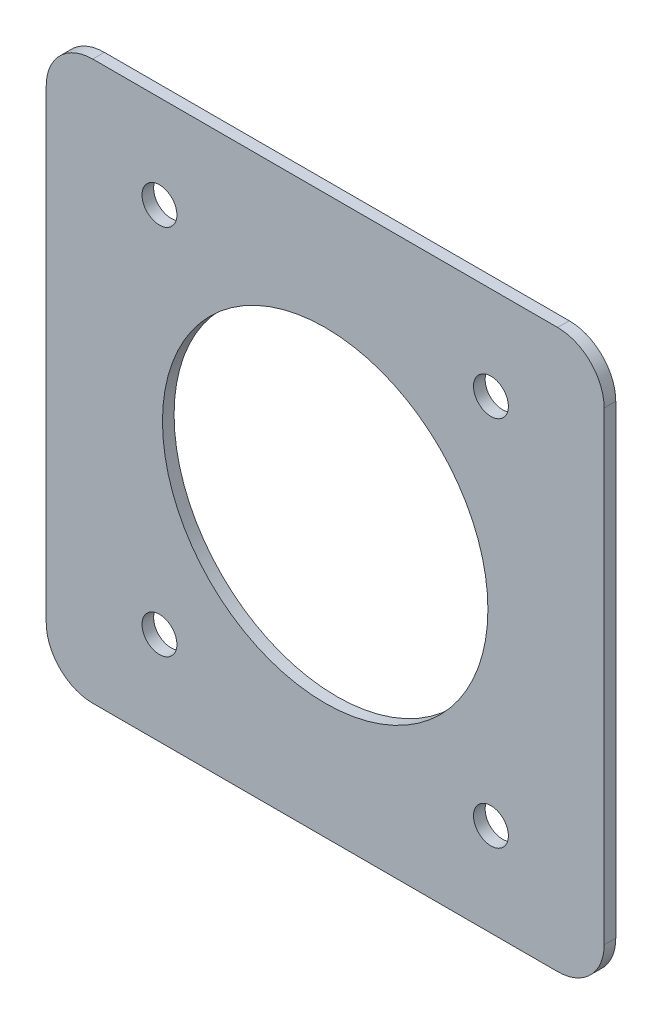
ISO-10303-21;
HEADER;
FILE_DESCRIPTION(('STEP AP214'),'2;1');
FILE_NAME('part.step','',(''),(''),'','','');
FILE_SCHEMA(('AUTOMOTIVE_DESIGN { 1 0 10303 214 1 1 1 1 }'));
ENDSEC;
DATA;
#1=APPLICATION_CONTEXT('core data for automotive mechanical design processes');
#2=APPLICATION_PROTOCOL_DEFINITION('international standard','automotive_design',2000,#1);
#3=PRODUCT_CONTEXT('',#1,'mechanical');
#4=PRODUCT('Part','Part','',(#3));
#5=PRODUCT_RELATED_PRODUCT_CATEGORY('part','',(#4));
#6=PRODUCT_DEFINITION_FORMATION('','',#4);
#7=PRODUCT_DEFINITION_CONTEXT('part definition',#1,'design');
#8=PRODUCT_DEFINITION('design','',#6,#7);
#9=PRODUCT_DEFINITION_SHAPE('','',#8);
#10=(LENGTH_UNIT() NAMED_UNIT(*) SI_UNIT(.MILLI.,.METRE.));
#11=(NAMED_UNIT(*) PLANE_ANGLE_UNIT() SI_UNIT($,.RADIAN.));
#12=(NAMED_UNIT(*) SI_UNIT($,.STERADIAN.) SOLID_ANGLE_UNIT());
#13=UNCERTAINTY_MEASURE_WITH_UNIT(LENGTH_MEASURE(1.E-05),#10,'distance_accuracy_value','');
#14=(GEOMETRIC_REPRESENTATION_CONTEXT(3) GLOBAL_UNCERTAINTY_ASSIGNED_CONTEXT((#13)) GLOBAL_UNIT_ASSIGNED_CONTEXT((#10,
#11,#12)) REPRESENTATION_CONTEXT('',''));
#15=CARTESIAN_POINT('',(0.,0.,0.));
#16=DIRECTION('',(0.,0.,1.));
#17=DIRECTION('',(1.,0.,0.));
#18=AXIS2_PLACEMENT_3D('',#15,#16,#17);
#19=CARTESIAN_POINT('',(-103.997719315894,137.785716341258,3.175));
#20=DIRECTION('',(0.,0.,-1.));
#21=DIRECTION('',(-1.,0.,0.));
#22=AXIS2_PLACEMENT_3D('',#19,#20,#21);
#23=CYLINDRICAL_SURFACE('',#22,12.7);
#24=CARTESIAN_POINT('',(-103.997719315894,137.785716341258,0.));
#25=DIRECTION('',(0.,0.,1.));
#26=DIRECTION('',(1.,0.,0.));
#27=AXIS2_PLACEMENT_3D('',#24,#25,#26);
#28=CIRCLE('',#27,12.7);
#29=CARTESIAN_POINT('',(-103.997719315894,150.485716341258,0.));
#30=VERTEX_POINT('',#29);
#31=CARTESIAN_POINT('',(-91.2977193158941,137.785716341258,0.));
#32=VERTEX_POINT('',#31);
#33=EDGE_CURVE('E142',#30,#32,#28,.F.);
#34=ORIENTED_EDGE('',*,*,#33,.F.);
#35=DIRECTION('',(0.,0.,-1.));
#36=VECTOR('',#35,1.);
#37=CARTESIAN_POINT('',(-103.997719315894,150.485716341258,3.175));
#38=LINE('',#37,#36);
#39=CARTESIAN_POINT('',(-103.997719315894,150.485716341258,3.175));
#40=VERTEX_POINT('',#39);
#41=EDGE_CURVE('E11',#40,#30,#38,.T.);
#42=ORIENTED_EDGE('',*,*,#41,.F.);
#43=CARTESIAN_POINT('',(-103.997719315894,137.785716341258,3.175));
#44=DIRECTION('',(0.,0.,1.));
#45=DIRECTION('',(1.,0.,0.));
#46=AXIS2_PLACEMENT_3D('',#43,#44,#45);
#47=CIRCLE('',#46,12.7);
#48=CARTESIAN_POINT('',(-91.2977193158941,137.785716341258,3.175));
#49=VERTEX_POINT('',#48);
#50=EDGE_CURVE('E172',#40,#49,#47,.F.);
#51=ORIENTED_EDGE('',*,*,#50,.T.);
#52=DIRECTION('',(0.,0.,-1.));
#53=VECTOR('',#52,1.);
#54=CARTESIAN_POINT('',(-91.2977193158941,137.785716341258,3.175));
#55=LINE('',#54,#53);
#56=EDGE_CURVE('E52',#49,#32,#55,.T.);
#57=ORIENTED_EDGE('',*,*,#56,.T.);
#58=EDGE_LOOP('',(#34,#42,#51,#57));
#59=FACE_BOUND('',#58,.T.);
#60=ADVANCED_FACE('F36',(#59),#23,.T.);
#61=CARTESIAN_POINT('',(0.,150.485716341258,3.175));
#62=DIRECTION('',(0.,1.,0.));
#63=DIRECTION('',(0.,0.,1.));
#64=AXIS2_PLACEMENT_3D('',#61,#62,#63);
#65=PLANE('',#64);
#66=DIRECTION('',(1.,0.,0.));
#67=VECTOR('',#66,1.);
#68=CARTESIAN_POINT('',(0.,150.485716341258,0.));
#69=LINE('',#68,#67);
#70=CARTESIAN_POINT('',(-230.997719315894,150.485716341258,0.));
#71=VERTEX_POINT('',#70);
#72=EDGE_CURVE('E144',#71,#30,#69,.T.);
#73=ORIENTED_EDGE('',*,*,#72,.F.);
#74=DIRECTION('',(0.,0.,-1.));
#75=VECTOR('',#74,1.);
#76=CARTESIAN_POINT('',(-230.997719315894,150.485716341258,3.175));
#77=LINE('',#76,#75);
#78=CARTESIAN_POINT('',(-230.997719315894,150.485716341258,3.175));
#79=VERTEX_POINT('',#78);
#80=EDGE_CURVE('E44',#79,#71,#77,.T.);
#81=ORIENTED_EDGE('',*,*,#80,.F.);
#82=DIRECTION('',(1.,0.,0.));
#83=VECTOR('',#82,1.);
#84=CARTESIAN_POINT('',(0.,150.485716341258,3.175));
#85=LINE('',#84,#83);
#86=EDGE_CURVE('E197',#79,#40,#85,.T.);
#87=ORIENTED_EDGE('',*,*,#86,.T.);
#88=ORIENTED_EDGE('',*,*,#41,.T.);
#89=EDGE_LOOP('',(#73,#81,#87,#88));
#90=FACE_BOUND('',#89,.T.);
#91=ADVANCED_FACE('F196',(#90),#65,.T.);
#92=CARTESIAN_POINT('',(-230.997719315894,137.785716341258,3.175));
#93=DIRECTION('',(0.,0.,-1.));
#94=DIRECTION('',(-1.,0.,0.));
#95=AXIS2_PLACEMENT_3D('',#92,#93,#94);
#96=CYLINDRICAL_SURFACE('',#95,12.7);
#97=CARTESIAN_POINT('',(-230.997719315894,137.785716341258,0.));
#98=DIRECTION('',(0.,0.,1.));
#99=DIRECTION('',(1.,0.,0.));
#100=AXIS2_PLACEMENT_3D('',#97,#98,#99);
#101=CIRCLE('',#100,12.7);
#102=CARTESIAN_POINT('',(-243.697719315894,137.785716341258,0.));
#103=VERTEX_POINT('',#102);
#104=EDGE_CURVE('E148',#71,#103,#101,.T.);
#105=ORIENTED_EDGE('',*,*,#104,.T.);
#106=DIRECTION('',(0.,0.,-1.));
#107=VECTOR('',#106,1.);
#108=CARTESIAN_POINT('',(-243.697719315894,137.785716341258,3.175));
#109=LINE('',#108,#107);
#110=CARTESIAN_POINT('',(-243.697719315894,137.785716341258,3.175));
#111=VERTEX_POINT('',#110);
#112=EDGE_CURVE('E179',#111,#103,#109,.T.);
#113=ORIENTED_EDGE('',*,*,#112,.F.);
#114=CARTESIAN_POINT('',(-230.997719315894,137.785716341258,3.175));
#115=DIRECTION('',(0.,0.,1.));
#116=DIRECTION('',(1.,0.,0.));
#117=AXIS2_PLACEMENT_3D('',#114,#115,#116);
#118=CIRCLE('',#117,12.7);
#119=EDGE_CURVE('E186',#79,#111,#118,.T.);
#120=ORIENTED_EDGE('',*,*,#119,.F.);
#121=ORIENTED_EDGE('',*,*,#80,.T.);
#122=EDGE_LOOP('',(#105,#113,#120,#121));
#123=FACE_BOUND('',#122,.T.);
#124=ADVANCED_FACE('F184',(#123),#96,.T.);
#125=CARTESIAN_POINT('',(-243.697719315894,0.,3.175));
#126=DIRECTION('',(1.,0.,0.));
#127=DIRECTION('',(0.,1.,0.));
#128=AXIS2_PLACEMENT_3D('',#125,#126,#127);
#129=PLANE('',#128);
#130=DIRECTION('',(0.,-1.,0.));
#131=VECTOR('',#130,1.);
#132=CARTESIAN_POINT('',(-243.697719315894,0.,0.));
#133=LINE('',#132,#131);
#134=CARTESIAN_POINT('',(-243.697719315894,10.7857163412583,0.));
#135=VERTEX_POINT('',#134);
#136=EDGE_CURVE('E150',#103,#135,#133,.T.);
#137=ORIENTED_EDGE('',*,*,#136,.T.);
#138=DIRECTION('',(0.,0.,-1.));
#139=VECTOR('',#138,1.);
#140=CARTESIAN_POINT('',(-243.697719315894,10.7857163412583,3.175));
#141=LINE('',#140,#139);
#142=CARTESIAN_POINT('',(-243.697719315894,10.7857163412583,3.175));
#143=VERTEX_POINT('',#142);
#144=EDGE_CURVE('E176',#143,#135,#141,.T.);
#145=ORIENTED_EDGE('',*,*,#144,.F.);
#146=DIRECTION('',(0.,-1.,0.));
#147=VECTOR('',#146,1.);
#148=CARTESIAN_POINT('',(-243.697719315894,0.,3.175));
#149=LINE('',#148,#147);
#150=EDGE_CURVE('E268',#111,#143,#149,.T.);
#151=ORIENTED_EDGE('',*,*,#150,.F.);
#152=ORIENTED_EDGE('',*,*,#112,.T.);
#153=EDGE_LOOP('',(#137,#145,#151,#152));
#154=FACE_BOUND('',#153,.T.);
#155=ADVANCED_FACE('F220',(#154),#129,.F.);
#156=CARTESIAN_POINT('',(-230.997719315894,10.7857163412582,3.175));
#157=DIRECTION('',(0.,0.,-1.));
#158=DIRECTION('',(-1.,0.,0.));
#159=AXIS2_PLACEMENT_3D('',#156,#157,#158);
#160=CYLINDRICAL_SURFACE('',#159,12.7);
#161=CARTESIAN_POINT('',(-230.997719315894,10.7857163412582,0.));
#162=DIRECTION('',(0.,0.,1.));
#163=DIRECTION('',(1.,0.,0.));
#164=AXIS2_PLACEMENT_3D('',#161,#162,#163);
#165=CIRCLE('',#164,12.7);
#166=CARTESIAN_POINT('',(-230.997719315894,-1.91428365874183,0.));
#167=VERTEX_POINT('',#166);
#168=EDGE_CURVE('E152',#135,#167,#165,.T.);
#169=ORIENTED_EDGE('',*,*,#168,.T.);
#170=DIRECTION('',(0.,0.,-1.));
#171=VECTOR('',#170,1.);
#172=CARTESIAN_POINT('',(-230.997719315894,-1.91428365874183,3.175));
#173=LINE('',#172,#171);
#174=CARTESIAN_POINT('',(-230.997719315894,-1.91428365874183,3.175));
#175=VERTEX_POINT('',#174);
#176=EDGE_CURVE('E122',#175,#167,#173,.T.);
#177=ORIENTED_EDGE('',*,*,#176,.F.);
#178=CARTESIAN_POINT('',(-230.997719315894,10.7857163412582,3.175));
#179=DIRECTION('',(0.,0.,1.));
#180=DIRECTION('',(1.,0.,0.));
#181=AXIS2_PLACEMENT_3D('',#178,#179,#180);
#182=CIRCLE('',#181,12.7);
#183=EDGE_CURVE('E110',#143,#175,#182,.T.);
#184=ORIENTED_EDGE('',*,*,#183,.F.);
#185=ORIENTED_EDGE('',*,*,#144,.T.);
#186=EDGE_LOOP('',(#169,#177,#184,#185));
#187=FACE_BOUND('',#186,.T.);
#188=ADVANCED_FACE('F225',(#187),#160,.T.);
#189=CARTESIAN_POINT('',(0.,-1.9142836587418,3.175));
#190=DIRECTION('',(0.,1.,0.));
#191=DIRECTION('',(-1.,0.,0.));
#192=AXIS2_PLACEMENT_3D('',#189,#190,#191);
#193=PLANE('',#192);
#194=DIRECTION('',(1.,0.,0.));
#195=VECTOR('',#194,1.);
#196=CARTESIAN_POINT('',(0.,-1.9142836587418,0.));
#197=LINE('',#196,#195);
#198=CARTESIAN_POINT('',(-103.997719315894,-1.91428365874181,0.));
#199=VERTEX_POINT('',#198);
#200=EDGE_CURVE('E119',#167,#199,#197,.T.);
#201=ORIENTED_EDGE('',*,*,#200,.T.);
#202=DIRECTION('',(0.,0.,-1.));
#203=VECTOR('',#202,1.);
#204=CARTESIAN_POINT('',(-103.997719315894,-1.91428365874181,3.175));
#205=LINE('',#204,#203);
#206=CARTESIAN_POINT('',(-103.997719315894,-1.91428365874181,3.175));
#207=VERTEX_POINT('',#206);
#208=EDGE_CURVE('E116',#207,#199,#205,.T.);
#209=ORIENTED_EDGE('',*,*,#208,.F.);
#210=DIRECTION('',(1.,0.,0.));
#211=VECTOR('',#210,1.);
#212=CARTESIAN_POINT('',(0.,-1.9142836587418,3.175));
#213=LINE('',#212,#211);
#214=EDGE_CURVE('E102',#175,#207,#213,.T.);
#215=ORIENTED_EDGE('',*,*,#214,.F.);
#216=ORIENTED_EDGE('',*,*,#176,.T.);
#217=EDGE_LOOP('',(#201,#209,#215,#216));
#218=FACE_BOUND('',#217,.T.);
#219=ADVANCED_FACE('F117',(#218),#193,.F.);
#220=CARTESIAN_POINT('',(-103.997719315894,10.7857163412582,3.175));
#221=DIRECTION('',(0.,0.,-1.));
#222=DIRECTION('',(-1.,0.,0.));
#223=AXIS2_PLACEMENT_3D('',#220,#221,#222);
#224=CYLINDRICAL_SURFACE('',#223,12.7);
#225=CARTESIAN_POINT('',(-103.997719315894,10.7857163412582,0.));
#226=DIRECTION('',(0.,0.,1.));
#227=DIRECTION('',(1.,0.,0.));
#228=AXIS2_PLACEMENT_3D('',#225,#226,#227);
#229=CIRCLE('',#228,12.7);
#230=CARTESIAN_POINT('',(-91.297719315894,10.7857163412583,0.));
#231=VERTEX_POINT('',#230);
#232=EDGE_CURVE('E155',#199,#231,#229,.T.);
#233=ORIENTED_EDGE('',*,*,#232,.T.);
#234=DIRECTION('',(0.,0.,-1.));
#235=VECTOR('',#234,1.);
#236=CARTESIAN_POINT('',(-91.297719315894,10.7857163412583,3.175));
#237=LINE('',#236,#235);
#238=CARTESIAN_POINT('',(-91.297719315894,10.7857163412583,3.175));
#239=VERTEX_POINT('',#238);
#240=EDGE_CURVE('E78',#239,#231,#237,.T.);
#241=ORIENTED_EDGE('',*,*,#240,.F.);
#242=CARTESIAN_POINT('',(-103.997719315894,10.7857163412582,3.175));
#243=DIRECTION('',(0.,0.,1.));
#244=DIRECTION('',(1.,0.,0.));
#245=AXIS2_PLACEMENT_3D('',#242,#243,#244);
#246=CIRCLE('',#245,12.7);
#247=EDGE_CURVE('E108',#207,#239,#246,.T.);
#248=ORIENTED_EDGE('',*,*,#247,.F.);
#249=ORIENTED_EDGE('',*,*,#208,.T.);
#250=EDGE_LOOP('',(#233,#241,#248,#249));
#251=FACE_BOUND('',#250,.T.);
#252=ADVANCED_FACE('F124',(#251),#224,.T.);
#253=CARTESIAN_POINT('',(-212.773219315894,125.085716341257,3.175));
#254=DIRECTION('',(0.,0.,-1.));
#255=DIRECTION('',(-1.,0.,0.));
#256=AXIS2_PLACEMENT_3D('',#253,#254,#255);
#257=CYLINDRICAL_SURFACE('',#256,4.76249999999992);
#258=CARTESIAN_POINT('',(-212.773219315894,125.085716341257,3.175));
#259=DIRECTION('',(0.,0.,1.));
#260=DIRECTION('',(1.,0.,0.));
#261=AXIS2_PLACEMENT_3D('',#258,#259,#260);
#262=CIRCLE('',#261,4.76249999999992);
#263=CARTESIAN_POINT('',(-208.010719315894,125.085716341257,3.175));
#264=VERTEX_POINT('',#263);
#265=EDGE_CURVE('E136',#264,#264,#262,.T.);
#266=ORIENTED_EDGE('',*,*,#265,.T.);
#267=EDGE_LOOP('',(#266));
#268=FACE_BOUND('',#267,.T.);
#269=CARTESIAN_POINT('',(-212.773219315894,125.085716341257,0.));
#270=DIRECTION('',(0.,0.,1.));
#271=DIRECTION('',(1.,0.,0.));
#272=AXIS2_PLACEMENT_3D('',#269,#270,#271);
#273=CIRCLE('',#272,4.76249999999992);
#274=CARTESIAN_POINT('',(-208.010719315894,125.085716341257,0.));
#275=VERTEX_POINT('',#274);
#276=EDGE_CURVE('E166',#275,#275,#273,.T.);
#277=ORIENTED_EDGE('',*,*,#276,.F.);
#278=EDGE_LOOP('',(#277));
#279=FACE_BOUND('',#278,.T.);
#280=ADVANCED_FACE('F232',(#268,#279),#257,.F.);
#281=CARTESIAN_POINT('',(-212.773219315894,23.4857163412565,3.175));
#282=DIRECTION('',(0.,0.,-1.));
#283=DIRECTION('',(-1.,0.,0.));
#284=AXIS2_PLACEMENT_3D('',#281,#282,#283);
#285=CYLINDRICAL_SURFACE('',#284,4.76249999999992);
#286=CARTESIAN_POINT('',(-212.773219315894,23.4857163412565,3.175));
#287=DIRECTION('',(0.,0.,1.));
#288=DIRECTION('',(1.,0.,0.));
#289=AXIS2_PLACEMENT_3D('',#286,#287,#288);
#290=CIRCLE('',#289,4.76249999999992);
#291=CARTESIAN_POINT('',(-208.010719315894,23.4857163412565,3.175));
#292=VERTEX_POINT('',#291);
#293=EDGE_CURVE('E133',#292,#292,#290,.T.);
#294=ORIENTED_EDGE('',*,*,#293,.T.);
#295=EDGE_LOOP('',(#294));
#296=FACE_BOUND('',#295,.T.);
#297=CARTESIAN_POINT('',(-212.773219315894,23.4857163412565,0.));
#298=DIRECTION('',(0.,0.,1.));
#299=DIRECTION('',(1.,0.,0.));
#300=AXIS2_PLACEMENT_3D('',#297,#298,#299);
#301=CIRCLE('',#300,4.76249999999992);
#302=CARTESIAN_POINT('',(-208.010719315894,23.4857163412565,0.));
#303=VERTEX_POINT('',#302);
#304=EDGE_CURVE('E163',#303,#303,#301,.T.);
#305=ORIENTED_EDGE('',*,*,#304,.F.);
#306=EDGE_LOOP('',(#305));
#307=FACE_BOUND('',#306,.T.);
#308=ADVANCED_FACE('F209',(#296,#307),#285,.F.);
#309=CARTESIAN_POINT('',(-122.222219315894,23.4857163412565,3.175));
#310=DIRECTION('',(0.,0.,-1.));
#311=DIRECTION('',(-1.,0.,0.));
#312=AXIS2_PLACEMENT_3D('',#309,#310,#311);
#313=CYLINDRICAL_SURFACE('',#312,4.76249999999992);
#314=CARTESIAN_POINT('',(-122.222219315894,23.4857163412565,3.175));
#315=DIRECTION('',(0.,0.,1.));
#316=DIRECTION('',(1.,0.,0.));
#317=AXIS2_PLACEMENT_3D('',#314,#315,#316);
#318=CIRCLE('',#317,4.76249999999992);
#319=CARTESIAN_POINT('',(-117.459719315894,23.4857163412565,3.175));
#320=VERTEX_POINT('',#319);
#321=EDGE_CURVE('E127',#320,#320,#318,.T.);
#322=ORIENTED_EDGE('',*,*,#321,.T.);
#323=EDGE_LOOP('',(#322));
#324=FACE_BOUND('',#323,.T.);
#325=CARTESIAN_POINT('',(-122.222219315894,23.4857163412565,0.));
#326=DIRECTION('',(0.,0.,1.));
#327=DIRECTION('',(1.,0.,0.));
#328=AXIS2_PLACEMENT_3D('',#325,#326,#327);
#329=CIRCLE('',#328,4.76249999999992);
#330=CARTESIAN_POINT('',(-117.459719315894,23.4857163412565,0.));
#331=VERTEX_POINT('',#330);
#332=EDGE_CURVE('E160',#331,#331,#329,.T.);
#333=ORIENTED_EDGE('',*,*,#332,.F.);
#334=EDGE_LOOP('',(#333));
#335=FACE_BOUND('',#334,.T.);
#336=ADVANCED_FACE('F201',(#324,#335),#313,.F.);
#337=CARTESIAN_POINT('',(-91.297719315894,0.,3.175));
#338=DIRECTION('',(1.,0.,0.));
#339=DIRECTION('',(0.,1.,0.));
#340=AXIS2_PLACEMENT_3D('',#337,#338,#339);
#341=PLANE('',#340);
#342=DIRECTION('',(0.,-1.,0.));
#343=VECTOR('',#342,1.);
#344=CARTESIAN_POINT('',(-91.297719315894,0.,0.));
#345=LINE('',#344,#343);
#346=EDGE_CURVE('E157',#32,#231,#345,.T.);
#347=ORIENTED_EDGE('',*,*,#346,.F.);
#348=ORIENTED_EDGE('',*,*,#56,.F.);
#349=DIRECTION('',(0.,-1.,0.));
#350=VECTOR('',#349,1.);
#351=CARTESIAN_POINT('',(-91.297719315894,0.,3.175));
#352=LINE('',#351,#350);
#353=EDGE_CURVE('E125',#49,#239,#352,.T.);
#354=ORIENTED_EDGE('',*,*,#353,.T.);
#355=ORIENTED_EDGE('',*,*,#240,.T.);
#356=EDGE_LOOP('',(#347,#348,#354,#355));
#357=FACE_BOUND('',#356,.T.);
#358=ADVANCED_FACE('F198',(#357),#341,.T.);
#359=CARTESIAN_POINT('',(-122.222219315894,125.085716341257,3.175));
#360=DIRECTION('',(0.,0.,-1.));
#361=DIRECTION('',(-1.,0.,0.));
#362=AXIS2_PLACEMENT_3D('',#359,#360,#361);
#363=CYLINDRICAL_SURFACE('',#362,4.76249999999992);
#364=CARTESIAN_POINT('',(-122.222219315894,125.085716341257,3.175));
#365=DIRECTION('',(0.,0.,1.));
#366=DIRECTION('',(1.,0.,0.));
#367=AXIS2_PLACEMENT_3D('',#364,#365,#366);
#368=CIRCLE('',#367,4.76249999999992);
#369=CARTESIAN_POINT('',(-117.459719315894,125.085716341257,3.175));
#370=VERTEX_POINT('',#369);
#371=EDGE_CURVE('E139',#370,#370,#368,.T.);
#372=ORIENTED_EDGE('',*,*,#371,.T.);
#373=EDGE_LOOP('',(#372));
#374=FACE_BOUND('',#373,.T.);
#375=CARTESIAN_POINT('',(-122.222219315894,125.085716341257,0.));
#376=DIRECTION('',(0.,0.,1.));
#377=DIRECTION('',(1.,0.,0.));
#378=AXIS2_PLACEMENT_3D('',#375,#376,#377);
#379=CIRCLE('',#378,4.76249999999992);
#380=CARTESIAN_POINT('',(-117.459719315894,125.085716341257,0.));
#381=VERTEX_POINT('',#380);
#382=EDGE_CURVE('E169',#381,#381,#379,.T.);
#383=ORIENTED_EDGE('',*,*,#382,.F.);
#384=EDGE_LOOP('',(#383));
#385=FACE_BOUND('',#384,.T.);
#386=ADVANCED_FACE('F200',(#374,#385),#363,.F.);
#387=CARTESIAN_POINT('',(0.,0.,3.175));
#388=DIRECTION('',(0.,0.,1.));
#389=DIRECTION('',(1.,0.,0.));
#390=AXIS2_PLACEMENT_3D('',#387,#388,#389);
#391=PLANE('',#390);
#392=CARTESIAN_POINT('',(-167.497719315894,74.2857163412582,3.175));
#393=DIRECTION('',(0.,0.,1.));
#394=DIRECTION('',(1.,0.,0.));
#395=AXIS2_PLACEMENT_3D('',#392,#393,#394);
#396=CIRCLE('',#395,44.45);
#397=CARTESIAN_POINT('',(-123.047719315894,74.2857163412582,3.175));
#398=VERTEX_POINT('',#397);
#399=EDGE_CURVE('E261',#398,#398,#396,.T.);
#400=ORIENTED_EDGE('',*,*,#399,.F.);
#401=EDGE_LOOP('',(#400));
#402=FACE_BOUND('',#401,.T.);
#403=ORIENTED_EDGE('',*,*,#50,.F.);
#404=ORIENTED_EDGE('',*,*,#86,.F.);
#405=ORIENTED_EDGE('',*,*,#119,.T.);
#406=ORIENTED_EDGE('',*,*,#150,.T.);
#407=ORIENTED_EDGE('',*,*,#183,.T.);
#408=ORIENTED_EDGE('',*,*,#214,.T.);
#409=ORIENTED_EDGE('',*,*,#247,.T.);
#410=ORIENTED_EDGE('',*,*,#353,.F.);
#411=EDGE_LOOP('',(#403,#404,#405,#406,#407,#408,#409,#410));
#412=FACE_BOUND('',#411,.T.);
#413=ORIENTED_EDGE('',*,*,#321,.F.);
#414=EDGE_LOOP('',(#413));
#415=FACE_BOUND('',#414,.T.);
#416=ORIENTED_EDGE('',*,*,#293,.F.);
#417=EDGE_LOOP('',(#416));
#418=FACE_BOUND('',#417,.T.);
#419=ORIENTED_EDGE('',*,*,#265,.F.);
#420=EDGE_LOOP('',(#419));
#421=FACE_BOUND('',#420,.T.);
#422=ORIENTED_EDGE('',*,*,#371,.F.);
#423=EDGE_LOOP('',(#422));
#424=FACE_BOUND('',#423,.T.);
#425=ADVANCED_FACE('F104',(#402,#412,#415,#418,#421,#424),#391,.T.);
#426=CARTESIAN_POINT('',(0.,0.,0.));
#427=DIRECTION('',(0.,0.,1.));
#428=DIRECTION('',(1.,0.,0.));
#429=AXIS2_PLACEMENT_3D('',#426,#427,#428);
#430=PLANE('',#429);
#431=CARTESIAN_POINT('',(-167.497719315894,74.2857163412582,0.));
#432=DIRECTION('',(0.,0.,1.));
#433=DIRECTION('',(1.,0.,0.));
#434=AXIS2_PLACEMENT_3D('',#431,#432,#433);
#435=CIRCLE('',#434,44.45);
#436=CARTESIAN_POINT('',(-123.047719315894,74.2857163412582,0.));
#437=VERTEX_POINT('',#436);
#438=EDGE_CURVE('E145',#437,#437,#435,.T.);
#439=ORIENTED_EDGE('',*,*,#438,.T.);
#440=EDGE_LOOP('',(#439));
#441=FACE_BOUND('',#440,.T.);
#442=ORIENTED_EDGE('',*,*,#33,.T.);
#443=ORIENTED_EDGE('',*,*,#346,.T.);
#444=ORIENTED_EDGE('',*,*,#232,.F.);
#445=ORIENTED_EDGE('',*,*,#200,.F.);
#446=ORIENTED_EDGE('',*,*,#168,.F.);
#447=ORIENTED_EDGE('',*,*,#136,.F.);
#448=ORIENTED_EDGE('',*,*,#104,.F.);
#449=ORIENTED_EDGE('',*,*,#72,.T.);
#450=EDGE_LOOP('',(#442,#443,#444,#445,#446,#447,#448,#449));
#451=FACE_BOUND('',#450,.T.);
#452=ORIENTED_EDGE('',*,*,#332,.T.);
#453=EDGE_LOOP('',(#452));
#454=FACE_BOUND('',#453,.T.);
#455=ORIENTED_EDGE('',*,*,#304,.T.);
#456=EDGE_LOOP('',(#455));
#457=FACE_BOUND('',#456,.T.);
#458=ORIENTED_EDGE('',*,*,#276,.T.);
#459=EDGE_LOOP('',(#458));
#460=FACE_BOUND('',#459,.T.);
#461=ORIENTED_EDGE('',*,*,#382,.T.);
#462=EDGE_LOOP('',(#461));
#463=FACE_BOUND('',#462,.T.);
#464=ADVANCED_FACE('F193',(#441,#451,#454,#457,#460,#463),#430,.F.);
#465=CARTESIAN_POINT('',(-167.497719315894,74.2857163412582,0.));
#466=DIRECTION('',(0.,0.,1.));
#467=DIRECTION('',(1.,0.,0.));
#468=AXIS2_PLACEMENT_3D('',#465,#466,#467);
#469=CYLINDRICAL_SURFACE('',#468,44.45);
#470=ORIENTED_EDGE('',*,*,#438,.F.);
#471=EDGE_LOOP('',(#470));
#472=FACE_BOUND('',#471,.T.);
#473=ORIENTED_EDGE('',*,*,#399,.T.);
#474=EDGE_LOOP('',(#473));
#475=FACE_BOUND('',#474,.T.);
#476=ADVANCED_FACE('F247',(#472,#475),#469,.F.);
#477=CLOSED_SHELL('',(#60,#91,#124,#155,#188,#219,#252,#280,#308,#336,#358,#386,#425,#464,#476));
#478=MANIFOLD_SOLID_BREP('B2',#477);
#479=ADVANCED_BREP_SHAPE_REPRESENTATION('',(#18,#478),#14);
#480=SHAPE_DEFINITION_REPRESENTATION(#9,#479);
ENDSEC;
END-ISO-10303-21;
